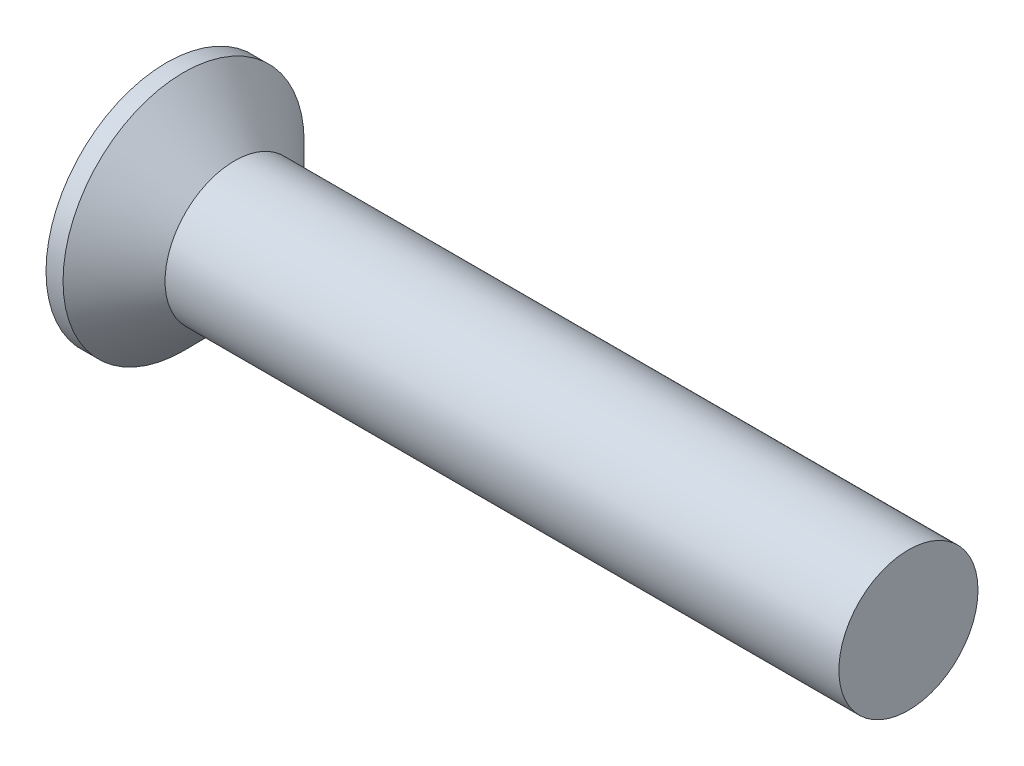
ISO-10303-21;
HEADER;
FILE_DESCRIPTION(('STEP AP214'),'2;1');
FILE_NAME('part.step','',(''),(''),'','','');
FILE_SCHEMA(('AUTOMOTIVE_DESIGN { 1 0 10303 214 1 1 1 1 }'));
ENDSEC;
DATA;
#1=APPLICATION_CONTEXT('core data for automotive mechanical design processes');
#2=APPLICATION_PROTOCOL_DEFINITION('international standard','automotive_design',2000,#1);
#3=PRODUCT_CONTEXT('',#1,'mechanical');
#4=PRODUCT('Part','Part','',(#3));
#5=PRODUCT_RELATED_PRODUCT_CATEGORY('part','',(#4));
#6=PRODUCT_DEFINITION_FORMATION('','',#4);
#7=PRODUCT_DEFINITION_CONTEXT('part definition',#1,'design');
#8=PRODUCT_DEFINITION('design','',#6,#7);
#9=PRODUCT_DEFINITION_SHAPE('','',#8);
#10=(LENGTH_UNIT() NAMED_UNIT(*) SI_UNIT(.MILLI.,.METRE.));
#11=(NAMED_UNIT(*) PLANE_ANGLE_UNIT() SI_UNIT($,.RADIAN.));
#12=(NAMED_UNIT(*) SI_UNIT($,.STERADIAN.) SOLID_ANGLE_UNIT());
#13=UNCERTAINTY_MEASURE_WITH_UNIT(LENGTH_MEASURE(1.E-05),#10,'distance_accuracy_value','');
#14=(GEOMETRIC_REPRESENTATION_CONTEXT(3) GLOBAL_UNCERTAINTY_ASSIGNED_CONTEXT((#13)) GLOBAL_UNIT_ASSIGNED_CONTEXT((#10,
#11,#12)) REPRESENTATION_CONTEXT('',''));
#15=CARTESIAN_POINT('',(0.,0.,0.));
#16=DIRECTION('',(0.,0.,1.));
#17=DIRECTION('',(1.,0.,0.));
#18=AXIS2_PLACEMENT_3D('',#15,#16,#17);
#19=CARTESIAN_POINT('',(16.,1.5,0.));
#20=DIRECTION('',(1.,0.,0.));
#21=DIRECTION('',(0.,0.,-1.));
#22=AXIS2_PLACEMENT_3D('',#19,#20,#21);
#23=PLANE('',#22);
#24=CARTESIAN_POINT('',(16.,0.,0.));
#25=DIRECTION('',(1.,0.,0.));
#26=DIRECTION('',(0.,0.,-1.));
#27=AXIS2_PLACEMENT_3D('',#24,#25,#26);
#28=CIRCLE('',#27,1.5);
#29=CARTESIAN_POINT('',(16.,0.,-1.5));
#30=VERTEX_POINT('',#29);
#31=EDGE_CURVE('E212',#30,#30,#28,.T.);
#32=ORIENTED_EDGE('',*,*,#31,.T.);
#33=EDGE_LOOP('',(#32));
#34=FACE_BOUND('',#33,.T.);
#35=ADVANCED_FACE('F39',(#34),#23,.T.);
#36=CARTESIAN_POINT('',(4.4785714285714,0.,0.));
#37=DIRECTION('',(0.,0.,1.));
#38=DIRECTION('',(1.,0.,0.));
#39=AXIS2_PLACEMENT_3D('',#36,#37,#38);
#40=SPHERICAL_SURFACE('',#39,5.1785714285714);
#41=CARTESIAN_POINT('',(4.4785714285714,-0.34,0.));
#42=DIRECTION('',(0.,-1.,0.));
#43=DIRECTION('',(0.,0.,-1.));
#44=AXIS2_PLACEMENT_3D('',#41,#42,#43);
#45=CIRCLE('',#44,5.16739799520185);
#46=CARTESIAN_POINT('',(-0.649040300178743,-0.34,0.64));
#47=VERTEX_POINT('',#46);
#48=CARTESIAN_POINT('',(-0.449236221463886,-0.34,1.55522146495917));
#49=VERTEX_POINT('',#48);
#50=EDGE_CURVE('E216',#47,#49,#45,.F.);
#51=ORIENTED_EDGE('',*,*,#50,.F.);
#52=CARTESIAN_POINT('',(-0.649040300178743,-0.34,0.64));
#53=CARTESIAN_POINT('',(-0.651125092654162,-0.339985289450023,0.623311452140583));
#54=CARTESIAN_POINT('',(-0.653033929290357,-0.341391829430021,0.606601424650036));
#55=CARTESIAN_POINT('',(-0.656452170050108,-0.346964127621354,0.5736121624894));
#56=CARTESIAN_POINT('',(-0.657961718297668,-0.351128888339867,0.557332774293918));
#57=CARTESIAN_POINT('',(-0.660536487111274,-0.362138947374793,0.525652873141929));
#58=CARTESIAN_POINT('',(-0.661601343834686,-0.368986431829208,0.510253088726624));
#59=CARTESIAN_POINT('',(-0.663252998096254,-0.385171176182099,0.480800931998128));
#60=CARTESIAN_POINT('',(-0.663839957231515,-0.394507593050013,0.466748105641541));
#61=CARTESIAN_POINT('',(-0.664515452071121,-0.415321472159786,0.4405062565739));
#62=CARTESIAN_POINT('',(-0.664608082666446,-0.426780527999705,0.428302737690038));
#63=CARTESIAN_POINT('',(-0.664303114987311,-0.451564797074484,0.405969181412248));
#64=CARTESIAN_POINT('',(-0.663905445161817,-0.464890282431521,0.395839446903564));
#65=CARTESIAN_POINT('',(-0.662634307516274,-0.492968256658572,0.37797394516552));
#66=CARTESIAN_POINT('',(-0.661762583572711,-0.507715353336347,0.370229565624028));
#67=CARTESIAN_POINT('',(-0.659570189800753,-0.538256524979789,0.357293431751204));
#68=CARTESIAN_POINT('',(-0.658249676480977,-0.554050233411553,0.352100789081599));
#69=CARTESIAN_POINT('',(-0.655638949519574,-0.58159529125856,0.345503933478422));
#70=CARTESIAN_POINT('',(-0.654449232328965,-0.593202962798242,0.343439686525628));
#71=CARTESIAN_POINT('',(-0.651881654056928,-0.616542796288321,0.34068755770359));
#72=CARTESIAN_POINT('',(-0.650504065142034,-0.628274755914445,0.339997706931737));
#73=CARTESIAN_POINT('',(-0.649040300178742,-0.64,0.34));
#74=B_SPLINE_CURVE_WITH_KNOTS('',3,(#52,#53,#54,#55,#56,#57,#58,#59,#60,#61,#62,#63,#64,#65,#66,
#67,#68,#69,#70,#71,#72,#73),.UNSPECIFIED.,.F.,.F.,(4,2,2,2,2,2,2,2,2,2,4),(0.,
0.0503945846133996,0.100770954293446,0.151188461094856,0.201588912545959,0.251571204016887,
0.301560790419327,0.351367714764633,0.401157287478689,0.436628333814892,0.472048529167462),.UNSPECIFIED.);
#75=CARTESIAN_POINT('',(-0.649040300178743,-0.64,0.34));
#76=VERTEX_POINT('',#75);
#77=EDGE_CURVE('E271',#47,#76,#74,.T.);
#78=ORIENTED_EDGE('',*,*,#77,.T.);
#79=CARTESIAN_POINT('',(4.4785714285714,0.,0.34));
#80=DIRECTION('',(0.,0.,1.));
#81=DIRECTION('',(1.,0.,0.));
#82=AXIS2_PLACEMENT_3D('',#79,#80,#81);
#83=CIRCLE('',#82,5.16739799520185);
#84=CARTESIAN_POINT('',(-0.449236221463887,-1.55522146495917,0.34));
#85=VERTEX_POINT('',#84);
#86=EDGE_CURVE('E190',#85,#76,#83,.F.);
#87=ORIENTED_EDGE('',*,*,#86,.F.);
#88=CARTESIAN_POINT('',(3.92005016464532,0.967387206227558,0.));
#89=DIRECTION('',(-0.500000000000001,0.866025403784438,0.));
#90=DIRECTION('',(-0.866025403784438,-0.500000000000001,0.));
#91=AXIS2_PLACEMENT_3D('',#88,#89,#90);
#92=CIRCLE('',#91,5.05666075901733);
#93=CARTESIAN_POINT('',(-0.449236221463887,-1.55522146495917,-0.339999999999999));
#94=VERTEX_POINT('',#93);
#95=EDGE_CURVE('E228',#94,#85,#92,.T.);
#96=ORIENTED_EDGE('',*,*,#95,.F.);
#97=CARTESIAN_POINT('',(4.4785714285714,0.,-0.34));
#98=DIRECTION('',(0.,0.,-1.));
#99=DIRECTION('',(0.,1.,0.));
#100=AXIS2_PLACEMENT_3D('',#97,#98,#99);
#101=CIRCLE('',#100,5.16739799520185);
#102=CARTESIAN_POINT('',(-0.649040300178743,-0.64,-0.34));
#103=VERTEX_POINT('',#102);
#104=EDGE_CURVE('E184',#103,#94,#101,.F.);
#105=ORIENTED_EDGE('',*,*,#104,.F.);
#106=CARTESIAN_POINT('',(-0.649040300178743,-0.64,-0.34));
#107=CARTESIAN_POINT('',(-0.651125092654162,-0.623311452140583,-0.339985289450022));
#108=CARTESIAN_POINT('',(-0.653033929290357,-0.606601424650036,-0.34139182943002));
#109=CARTESIAN_POINT('',(-0.656452170050108,-0.5736121624894,-0.346964127621354));
#110=CARTESIAN_POINT('',(-0.657961718297668,-0.557332774293918,-0.351128888339867));
#111=CARTESIAN_POINT('',(-0.660536487111274,-0.525652873141929,-0.362138947374792));
#112=CARTESIAN_POINT('',(-0.661601343834686,-0.510253088726624,-0.368986431829208));
#113=CARTESIAN_POINT('',(-0.663252998096254,-0.480800931998128,-0.385171176182099));
#114=CARTESIAN_POINT('',(-0.663839957231515,-0.466748105641541,-0.394507593050012));
#115=CARTESIAN_POINT('',(-0.664515452071121,-0.4405062565739,-0.415321472159785));
#116=CARTESIAN_POINT('',(-0.664608082666446,-0.428302737690037,-0.426780527999705));
#117=CARTESIAN_POINT('',(-0.664303114987311,-0.405969181412248,-0.451564797074484));
#118=CARTESIAN_POINT('',(-0.663905445161817,-0.395839446903564,-0.464890282431521));
#119=CARTESIAN_POINT('',(-0.662634307516274,-0.37797394516552,-0.492968256658571));
#120=CARTESIAN_POINT('',(-0.661762583572711,-0.370229565624028,-0.507715353336347));
#121=CARTESIAN_POINT('',(-0.659570189800753,-0.357293431751204,-0.538256524979788));
#122=CARTESIAN_POINT('',(-0.658249676480977,-0.352100789081599,-0.554050233411553));
#123=CARTESIAN_POINT('',(-0.655638949519574,-0.345503933478422,-0.581595291258559));
#124=CARTESIAN_POINT('',(-0.654449232328965,-0.343439686525628,-0.593202962798242));
#125=CARTESIAN_POINT('',(-0.651881654056928,-0.34068755770359,-0.61654279628832));
#126=CARTESIAN_POINT('',(-0.650504065142034,-0.339997706931737,-0.628274755914444));
#127=CARTESIAN_POINT('',(-0.649040300178742,-0.34,-0.639999999999999));
#128=B_SPLINE_CURVE_WITH_KNOTS('',3,(#106,#107,#108,#109,#110,#111,#112,#113,#114,#115,#116,
#117,#118,#119,#120,#121,#122,#123,#124,#125,#126,#127),.UNSPECIFIED.,.F.,.F.,(4,2,2,2,2,2,2,2,
2,2,4),(0.,0.0503945846133995,0.100770954293446,0.151188461094855,0.201588912545959,
0.251571204016887,0.301560790419327,0.351367714764633,0.401157287478689,0.436628333814892,
0.472048529167462),.UNSPECIFIED.);
#129=CARTESIAN_POINT('',(-0.649040300178743,-0.34,-0.639999999999999));
#130=VERTEX_POINT('',#129);
#131=EDGE_CURVE('E265',#103,#130,#128,.T.);
#132=ORIENTED_EDGE('',*,*,#131,.T.);
#133=CARTESIAN_POINT('',(4.4785714285714,-0.34,0.));
#134=DIRECTION('',(0.,-1.,0.));
#135=DIRECTION('',(0.,0.,-1.));
#136=AXIS2_PLACEMENT_3D('',#133,#134,#135);
#137=CIRCLE('',#136,5.16739799520185);
#138=CARTESIAN_POINT('',(-0.449236221463887,-0.34,-1.55522146495917));
#139=VERTEX_POINT('',#138);
#140=EDGE_CURVE('E181',#139,#130,#137,.F.);
#141=ORIENTED_EDGE('',*,*,#140,.F.);
#142=CARTESIAN_POINT('',(3.92005016464532,0.,0.967387206227558));
#143=DIRECTION('',(-0.500000000000001,0.,0.866025403784438));
#144=DIRECTION('',(0.866025403784438,0.,0.500000000000001));
#145=AXIS2_PLACEMENT_3D('',#142,#143,#144);
#146=CIRCLE('',#145,5.05666075901733);
#147=CARTESIAN_POINT('',(-0.449236221463887,0.34,-1.55522146495917));
#148=VERTEX_POINT('',#147);
#149=EDGE_CURVE('E169',#148,#139,#146,.T.);
#150=ORIENTED_EDGE('',*,*,#149,.F.);
#151=CARTESIAN_POINT('',(4.4785714285714,0.34,0.));
#152=DIRECTION('',(0.,1.,0.));
#153=DIRECTION('',(0.,0.,1.));
#154=AXIS2_PLACEMENT_3D('',#151,#152,#153);
#155=CIRCLE('',#154,5.16739799520185);
#156=CARTESIAN_POINT('',(-0.649040300178743,0.34,-0.64));
#157=VERTEX_POINT('',#156);
#158=EDGE_CURVE('E154',#157,#148,#155,.F.);
#159=ORIENTED_EDGE('',*,*,#158,.F.);
#160=CARTESIAN_POINT('',(-0.649040300178743,0.34,-0.64));
#161=CARTESIAN_POINT('',(-0.651125092654162,0.339985289450023,-0.623311452140583));
#162=CARTESIAN_POINT('',(-0.653033929290357,0.341391829430021,-0.606601424650036));
#163=CARTESIAN_POINT('',(-0.656452170050108,0.346964127621354,-0.5736121624894));
#164=CARTESIAN_POINT('',(-0.657961718297668,0.351128888339867,-0.557332774293917));
#165=CARTESIAN_POINT('',(-0.660536487111274,0.362138947374793,-0.525652873141928));
#166=CARTESIAN_POINT('',(-0.661601343834686,0.368986431829208,-0.510253088726624));
#167=CARTESIAN_POINT('',(-0.663252998096254,0.385171176182099,-0.480800931998128));
#168=CARTESIAN_POINT('',(-0.663839957231515,0.394507593050013,-0.466748105641541));
#169=CARTESIAN_POINT('',(-0.664515452071121,0.415321472159785,-0.4405062565739));
#170=CARTESIAN_POINT('',(-0.664608082666446,0.426780527999705,-0.428302737690037));
#171=CARTESIAN_POINT('',(-0.664303114987311,0.451564797074484,-0.405969181412247));
#172=CARTESIAN_POINT('',(-0.663905445161817,0.464890282431521,-0.395839446903563));
#173=CARTESIAN_POINT('',(-0.662634307516274,0.492968256658572,-0.37797394516552));
#174=CARTESIAN_POINT('',(-0.661762583572711,0.507715353336347,-0.370229565624028));
#175=CARTESIAN_POINT('',(-0.659570189800753,0.538256524979789,-0.357293431751204));
#176=CARTESIAN_POINT('',(-0.658249676480977,0.554050233411553,-0.352100789081598));
#177=CARTESIAN_POINT('',(-0.655638949519574,0.581595291258559,-0.345503933478421));
#178=CARTESIAN_POINT('',(-0.654449232328965,0.593202962798242,-0.343439686525627));
#179=CARTESIAN_POINT('',(-0.651881654056928,0.616542796288321,-0.34068755770359));
#180=CARTESIAN_POINT('',(-0.650504065142034,0.628274755914444,-0.339997706931736));
#181=CARTESIAN_POINT('',(-0.649040300178742,0.64,-0.34));
#182=B_SPLINE_CURVE_WITH_KNOTS('',3,(#160,#161,#162,#163,#164,#165,#166,#167,#168,#169,#170,
#171,#172,#173,#174,#175,#176,#177,#178,#179,#180,#181),.UNSPECIFIED.,.F.,.F.,(4,2,2,2,2,2,2,2,
2,2,4),(0.,0.0503945846133995,0.100770954293446,0.151188461094855,0.201588912545959,
0.251571204016887,0.301560790419327,0.351367714764633,0.401157287478689,0.436628333814891,
0.472048529167462),.UNSPECIFIED.);
#183=CARTESIAN_POINT('',(-0.649040300178743,0.64,-0.34));
#184=VERTEX_POINT('',#183);
#185=EDGE_CURVE('E248',#157,#184,#182,.T.);
#186=ORIENTED_EDGE('',*,*,#185,.T.);
#187=CARTESIAN_POINT('',(4.4785714285714,0.,-0.34));
#188=DIRECTION('',(0.,0.,-1.));
#189=DIRECTION('',(0.,1.,0.));
#190=AXIS2_PLACEMENT_3D('',#187,#188,#189);
#191=CIRCLE('',#190,5.16739799520185);
#192=CARTESIAN_POINT('',(-0.449236221463887,1.55522146495917,-0.34));
#193=VERTEX_POINT('',#192);
#194=EDGE_CURVE('E165',#193,#184,#191,.F.);
#195=ORIENTED_EDGE('',*,*,#194,.F.);
#196=CARTESIAN_POINT('',(3.92005016464532,-0.967387206227558,0.));
#197=DIRECTION('',(-0.500000000000001,-0.866025403784438,0.));
#198=DIRECTION('',(0.866025403784438,-0.500000000000001,0.));
#199=AXIS2_PLACEMENT_3D('',#196,#197,#198);
#200=CIRCLE('',#199,5.05666075901733);
#201=CARTESIAN_POINT('',(-0.449236221463887,1.55522146495917,0.34));
#202=VERTEX_POINT('',#201);
#203=EDGE_CURVE('E198',#202,#193,#200,.T.);
#204=ORIENTED_EDGE('',*,*,#203,.F.);
#205=CARTESIAN_POINT('',(4.4785714285714,0.,0.34));
#206=DIRECTION('',(0.,0.,1.));
#207=DIRECTION('',(1.,0.,0.));
#208=AXIS2_PLACEMENT_3D('',#205,#206,#207);
#209=CIRCLE('',#208,5.16739799520185);
#210=CARTESIAN_POINT('',(-0.649040300178743,0.64,0.34));
#211=VERTEX_POINT('',#210);
#212=EDGE_CURVE('E200',#211,#202,#209,.F.);
#213=ORIENTED_EDGE('',*,*,#212,.F.);
#214=CARTESIAN_POINT('',(-0.649040300178743,0.64,0.34));
#215=CARTESIAN_POINT('',(-0.651125092654162,0.623311452140583,0.339985289450023));
#216=CARTESIAN_POINT('',(-0.653033929290357,0.606601424650036,0.341391829430021));
#217=CARTESIAN_POINT('',(-0.656452170050108,0.5736121624894,0.346964127621354));
#218=CARTESIAN_POINT('',(-0.657961718297668,0.557332774293918,0.351128888339867));
#219=CARTESIAN_POINT('',(-0.660536487111274,0.525652873141928,0.362138947374793));
#220=CARTESIAN_POINT('',(-0.661601343834686,0.510253088726624,0.368986431829208));
#221=CARTESIAN_POINT('',(-0.663252998096254,0.480800931998128,0.3851711761821));
#222=CARTESIAN_POINT('',(-0.663839957231515,0.466748105641541,0.394507593050013));
#223=CARTESIAN_POINT('',(-0.664515452071121,0.4405062565739,0.415321472159786));
#224=CARTESIAN_POINT('',(-0.664608082666446,0.428302737690037,0.426780527999705));
#225=CARTESIAN_POINT('',(-0.664303114987311,0.405969181412247,0.451564797074485));
#226=CARTESIAN_POINT('',(-0.663905445161817,0.395839446903564,0.464890282431521));
#227=CARTESIAN_POINT('',(-0.662634307516274,0.37797394516552,0.492968256658572));
#228=CARTESIAN_POINT('',(-0.661762583572711,0.370229565624028,0.507715353336348));
#229=CARTESIAN_POINT('',(-0.659570189800753,0.357293431751204,0.538256524979789));
#230=CARTESIAN_POINT('',(-0.658249676480977,0.352100789081598,0.554050233411554));
#231=CARTESIAN_POINT('',(-0.655638949519574,0.345503933478422,0.58159529125856));
#232=CARTESIAN_POINT('',(-0.654449232328965,0.343439686525628,0.593202962798242));
#233=CARTESIAN_POINT('',(-0.651881654056928,0.34068755770359,0.616542796288321));
#234=CARTESIAN_POINT('',(-0.650504065142034,0.339997706931736,0.628274755914445));
#235=CARTESIAN_POINT('',(-0.649040300178742,0.34,0.64));
#236=B_SPLINE_CURVE_WITH_KNOTS('',3,(#214,#215,#216,#217,#218,#219,#220,#221,#222,#223,#224,
#225,#226,#227,#228,#229,#230,#231,#232,#233,#234,#235),.UNSPECIFIED.,.F.,.F.,(4,2,2,2,2,2,2,2,
2,2,4),(0.,0.0503945846133995,0.100770954293446,0.151188461094856,0.201588912545959,
0.251571204016887,0.301560790419327,0.351367714764633,0.401157287478689,0.436628333814891,
0.472048529167462),.UNSPECIFIED.);
#237=CARTESIAN_POINT('',(-0.649040300178743,0.34,0.64));
#238=VERTEX_POINT('',#237);
#239=EDGE_CURVE('E241',#211,#238,#236,.T.);
#240=ORIENTED_EDGE('',*,*,#239,.T.);
#241=CARTESIAN_POINT('',(4.4785714285714,0.34,0.));
#242=DIRECTION('',(0.,1.,0.));
#243=DIRECTION('',(0.,0.,1.));
#244=AXIS2_PLACEMENT_3D('',#241,#242,#243);
#245=CIRCLE('',#244,5.16739799520185);
#246=CARTESIAN_POINT('',(-0.449236221463886,0.34,1.55522146495917));
#247=VERTEX_POINT('',#246);
#248=EDGE_CURVE('E215',#247,#238,#245,.F.);
#249=ORIENTED_EDGE('',*,*,#248,.F.);
#250=CARTESIAN_POINT('',(3.92005016464532,0.,-0.967387206227558));
#251=DIRECTION('',(-0.500000000000001,0.,-0.866025403784438));
#252=DIRECTION('',(-0.866025403784438,0.,0.500000000000001));
#253=AXIS2_PLACEMENT_3D('',#250,#251,#252);
#254=CIRCLE('',#253,5.05666075901733);
#255=EDGE_CURVE('E213',#49,#247,#254,.T.);
#256=ORIENTED_EDGE('',*,*,#255,.F.);
#257=EDGE_LOOP('',(#51,#78,#87,#96,#105,#132,#141,#150,#159,#186,#195,#204,#213,#240,#249,#256));
#258=FACE_BOUND('',#257,.T.);
#259=CARTESIAN_POINT('',(0.,0.,0.));
#260=DIRECTION('',(1.,0.,0.));
#261=DIRECTION('',(0.,0.,-1.));
#262=AXIS2_PLACEMENT_3D('',#259,#260,#261);
#263=CIRCLE('',#262,2.59999999999999);
#264=CARTESIAN_POINT('',(0.,0.,-2.59999999999999));
#265=VERTEX_POINT('',#264);
#266=EDGE_CURVE('E182',#265,#265,#263,.T.);
#267=ORIENTED_EDGE('',*,*,#266,.F.);
#268=EDGE_LOOP('',(#267));
#269=FACE_BOUND('',#268,.T.);
#270=ADVANCED_FACE('F178',(#258,#269),#40,.T.);
#271=CARTESIAN_POINT('',(4.51581291088132,0.,0.));
#272=DIRECTION('',(1.,0.,0.));
#273=DIRECTION('',(0.,0.,-1.));
#274=AXIS2_PLACEMENT_3D('',#271,#272,#273);
#275=CYLINDRICAL_SURFACE('',#274,2.59999999999999);
#276=ORIENTED_EDGE('',*,*,#266,.T.);
#277=EDGE_LOOP('',(#276));
#278=FACE_BOUND('',#277,.T.);
#279=CARTESIAN_POINT('',(0.367367965644047,0.,0.));
#280=DIRECTION('',(1.,0.,0.));
#281=DIRECTION('',(0.,0.,-1.));
#282=AXIS2_PLACEMENT_3D('',#279,#280,#281);
#283=CIRCLE('',#282,2.59999999999999);
#284=CARTESIAN_POINT('',(0.367367965644047,0.,-2.59999999999999));
#285=VERTEX_POINT('',#284);
#286=EDGE_CURVE('E187',#285,#285,#283,.T.);
#287=ORIENTED_EDGE('',*,*,#286,.F.);
#288=EDGE_LOOP('',(#287));
#289=FACE_BOUND('',#288,.T.);
#290=ADVANCED_FACE('F258',(#278,#289),#275,.T.);
#291=CARTESIAN_POINT('',(1.46736796564404,0.,0.));
#292=DIRECTION('',(-1.,0.,0.));
#293=DIRECTION('',(0.,0.,1.));
#294=AXIS2_PLACEMENT_3D('',#291,#292,#293);
#295=CONICAL_SURFACE('',#294,1.49999999999999,0.78539816339745);
#296=ORIENTED_EDGE('',*,*,#286,.T.);
#297=EDGE_LOOP('',(#296));
#298=FACE_BOUND('',#297,.T.);
#299=CARTESIAN_POINT('',(1.46736796564404,0.,0.));
#300=DIRECTION('',(1.,0.,0.));
#301=DIRECTION('',(0.,0.,-1.));
#302=AXIS2_PLACEMENT_3D('',#299,#300,#301);
#303=CIRCLE('',#302,1.49999999999999);
#304=CARTESIAN_POINT('',(1.46736796564404,0.,-1.49999999999999));
#305=VERTEX_POINT('',#304);
#306=EDGE_CURVE('E301',#305,#305,#303,.T.);
#307=ORIENTED_EDGE('',*,*,#306,.F.);
#308=EDGE_LOOP('',(#307));
#309=FACE_BOUND('',#308,.T.);
#310=ADVANCED_FACE('F403',(#298,#309),#295,.T.);
#311=CARTESIAN_POINT('',(4.51581291088132,0.,0.));
#312=DIRECTION('',(1.,0.,0.));
#313=DIRECTION('',(0.,0.,-1.));
#314=AXIS2_PLACEMENT_3D('',#311,#312,#313);
#315=CYLINDRICAL_SURFACE('',#314,1.5);
#316=ORIENTED_EDGE('',*,*,#306,.T.);
#317=EDGE_LOOP('',(#316));
#318=FACE_BOUND('',#317,.T.);
#319=ORIENTED_EDGE('',*,*,#31,.F.);
#320=EDGE_LOOP('',(#319));
#321=FACE_BOUND('',#320,.T.);
#322=ADVANCED_FACE('F400',(#318,#321),#315,.T.);
#323=CARTESIAN_POINT('',(0.125,0.34,-0.34));
#324=DIRECTION('',(0.,1.,0.));
#325=DIRECTION('',(0.,0.,1.));
#326=AXIS2_PLACEMENT_3D('',#323,#324,#325);
#327=PLANE('',#326);
#328=DIRECTION('',(0.,0.,-1.));
#329=VECTOR('',#328,1.);
#330=CARTESIAN_POINT('',(0.125,0.34,-0.34));
#331=LINE('',#330,#329);
#332=CARTESIAN_POINT('',(0.125,0.34,-0.64));
#333=VERTEX_POINT('',#332);
#334=CARTESIAN_POINT('',(0.125,0.34,-1.22368602791856));
#335=VERTEX_POINT('',#334);
#336=EDGE_CURVE('E195',#333,#335,#331,.T.);
#337=ORIENTED_EDGE('',*,*,#336,.F.);
#338=DIRECTION('',(-1.,0.,0.));
#339=VECTOR('',#338,1.);
#340=CARTESIAN_POINT('',(0.125,0.34,-0.64));
#341=LINE('',#340,#339);
#342=EDGE_CURVE('E161',#333,#157,#341,.T.);
#343=ORIENTED_EDGE('',*,*,#342,.T.);
#344=ORIENTED_EDGE('',*,*,#158,.T.);
#345=DIRECTION('',(0.866025403784438,0.,0.500000000000001));
#346=VECTOR('',#345,1.);
#347=CARTESIAN_POINT('',(0.507647274573419,0.34,-1.00276452093892));
#348=LINE('',#347,#346);
#349=EDGE_CURVE('E158',#335,#148,#348,.F.);
#350=ORIENTED_EDGE('',*,*,#349,.F.);
#351=EDGE_LOOP('',(#337,#343,#344,#350));
#352=FACE_BOUND('',#351,.T.);
#353=ADVANCED_FACE('F157',(#352),#327,.F.);
#354=CARTESIAN_POINT('',(0.125,0.34,-0.34));
#355=DIRECTION('',(0.,0.,-1.));
#356=DIRECTION('',(0.,1.,0.));
#357=AXIS2_PLACEMENT_3D('',#354,#355,#356);
#358=PLANE('',#357);
#359=ORIENTED_EDGE('',*,*,#194,.T.);
#360=DIRECTION('',(-1.,0.,0.));
#361=VECTOR('',#360,1.);
#362=CARTESIAN_POINT('',(0.125,0.64,-0.34));
#363=LINE('',#362,#361);
#364=CARTESIAN_POINT('',(0.125,0.64,-0.34));
#365=VERTEX_POINT('',#364);
#366=EDGE_CURVE('E343',#184,#365,#363,.F.);
#367=ORIENTED_EDGE('',*,*,#366,.T.);
#368=DIRECTION('',(0.,-1.,0.));
#369=VECTOR('',#368,1.);
#370=CARTESIAN_POINT('',(0.125,0.34,-0.34));
#371=LINE('',#370,#369);
#372=CARTESIAN_POINT('',(0.125,1.22368602791856,-0.34));
#373=VERTEX_POINT('',#372);
#374=EDGE_CURVE('E174',#373,#365,#371,.T.);
#375=ORIENTED_EDGE('',*,*,#374,.F.);
#376=DIRECTION('',(0.866025403784438,-0.500000000000001,0.));
#377=VECTOR('',#376,1.);
#378=CARTESIAN_POINT('',(-0.7,1.7,-0.34));
#379=LINE('',#378,#377);
#380=EDGE_CURVE('E204',#373,#193,#379,.F.);
#381=ORIENTED_EDGE('',*,*,#380,.T.);
#382=EDGE_LOOP('',(#359,#367,#375,#381));
#383=FACE_BOUND('',#382,.T.);
#384=ADVANCED_FACE('F359',(#383),#358,.F.);
#385=CARTESIAN_POINT('',(-0.7,1.7,0.));
#386=DIRECTION('',(-0.500000000000001,-0.866025403784438,0.));
#387=DIRECTION('',(0.866025403784438,-0.500000000000001,0.));
#388=AXIS2_PLACEMENT_3D('',#385,#386,#387);
#389=PLANE('',#388);
#390=ORIENTED_EDGE('',*,*,#203,.T.);
#391=ORIENTED_EDGE('',*,*,#380,.F.);
#392=DIRECTION('',(0.,0.,1.));
#393=VECTOR('',#392,1.);
#394=CARTESIAN_POINT('',(0.125,1.22368602791856,-0.34));
#395=LINE('',#394,#393);
#396=CARTESIAN_POINT('',(0.125,1.22368602791856,0.34));
#397=VERTEX_POINT('',#396);
#398=EDGE_CURVE('E206',#397,#373,#395,.F.);
#399=ORIENTED_EDGE('',*,*,#398,.F.);
#400=DIRECTION('',(0.866025403784438,-0.500000000000001,0.));
#401=VECTOR('',#400,1.);
#402=CARTESIAN_POINT('',(0.507647274573418,1.00276452093892,0.34));
#403=LINE('',#402,#401);
#404=EDGE_CURVE('E201',#397,#202,#403,.F.);
#405=ORIENTED_EDGE('',*,*,#404,.T.);
#406=EDGE_LOOP('',(#390,#391,#399,#405));
#407=FACE_BOUND('',#406,.T.);
#408=ADVANCED_FACE('F362',(#407),#389,.T.);
#409=CARTESIAN_POINT('',(0.125,0.34,0.34));
#410=DIRECTION('',(0.,0.,1.));
#411=DIRECTION('',(1.,0.,0.));
#412=AXIS2_PLACEMENT_3D('',#409,#410,#411);
#413=PLANE('',#412);
#414=DIRECTION('',(0.,1.,0.));
#415=VECTOR('',#414,1.);
#416=CARTESIAN_POINT('',(0.125,0.34,0.34));
#417=LINE('',#416,#415);
#418=CARTESIAN_POINT('',(0.125,0.64,0.34));
#419=VERTEX_POINT('',#418);
#420=EDGE_CURVE('E209',#419,#397,#417,.T.);
#421=ORIENTED_EDGE('',*,*,#420,.F.);
#422=DIRECTION('',(-1.,0.,0.));
#423=VECTOR('',#422,1.);
#424=CARTESIAN_POINT('',(0.125,0.64,0.34));
#425=LINE('',#424,#423);
#426=EDGE_CURVE('E345',#419,#211,#425,.T.);
#427=ORIENTED_EDGE('',*,*,#426,.T.);
#428=ORIENTED_EDGE('',*,*,#212,.T.);
#429=ORIENTED_EDGE('',*,*,#404,.F.);
#430=EDGE_LOOP('',(#421,#427,#428,#429));
#431=FACE_BOUND('',#430,.T.);
#432=ADVANCED_FACE('F366',(#431),#413,.F.);
#433=CARTESIAN_POINT('',(0.125,0.34,0.34));
#434=DIRECTION('',(0.,1.,0.));
#435=DIRECTION('',(0.,0.,1.));
#436=AXIS2_PLACEMENT_3D('',#433,#434,#435);
#437=PLANE('',#436);
#438=ORIENTED_EDGE('',*,*,#248,.T.);
#439=DIRECTION('',(-1.,0.,0.));
#440=VECTOR('',#439,1.);
#441=CARTESIAN_POINT('',(0.125,0.34,0.64));
#442=LINE('',#441,#440);
#443=CARTESIAN_POINT('',(0.125,0.34,0.64));
#444=VERTEX_POINT('',#443);
#445=EDGE_CURVE('E55',#238,#444,#442,.F.);
#446=ORIENTED_EDGE('',*,*,#445,.T.);
#447=DIRECTION('',(0.,0.,-1.));
#448=VECTOR('',#447,1.);
#449=CARTESIAN_POINT('',(0.125,0.34,0.34));
#450=LINE('',#449,#448);
#451=CARTESIAN_POINT('',(0.125,0.34,1.22368602791856));
#452=VERTEX_POINT('',#451);
#453=EDGE_CURVE('E224',#452,#444,#450,.T.);
#454=ORIENTED_EDGE('',*,*,#453,.F.);
#455=DIRECTION('',(0.866025403784438,0.,-0.500000000000001));
#456=VECTOR('',#455,1.);
#457=CARTESIAN_POINT('',(-0.7,0.34,1.7));
#458=LINE('',#457,#456);
#459=EDGE_CURVE('E205',#452,#247,#458,.F.);
#460=ORIENTED_EDGE('',*,*,#459,.T.);
#461=EDGE_LOOP('',(#438,#446,#454,#460));
#462=FACE_BOUND('',#461,.T.);
#463=ADVANCED_FACE('F370',(#462),#437,.F.);
#464=CARTESIAN_POINT('',(-0.7,0.,1.7));
#465=DIRECTION('',(-0.500000000000001,0.,-0.866025403784438));
#466=DIRECTION('',(-0.866025403784438,0.,0.500000000000001));
#467=AXIS2_PLACEMENT_3D('',#464,#465,#466);
#468=PLANE('',#467);
#469=ORIENTED_EDGE('',*,*,#255,.T.);
#470=ORIENTED_EDGE('',*,*,#459,.F.);
#471=DIRECTION('',(0.,-1.,0.));
#472=VECTOR('',#471,1.);
#473=CARTESIAN_POINT('',(0.125,0.34,1.22368602791856));
#474=LINE('',#473,#472);
#475=CARTESIAN_POINT('',(0.125,-0.34,1.22368602791856));
#476=VERTEX_POINT('',#475);
#477=EDGE_CURVE('E221',#476,#452,#474,.F.);
#478=ORIENTED_EDGE('',*,*,#477,.F.);
#479=DIRECTION('',(0.866025403784438,0.,-0.500000000000001));
#480=VECTOR('',#479,1.);
#481=CARTESIAN_POINT('',(0.507647274573419,-0.34,1.00276452093892));
#482=LINE('',#481,#480);
#483=EDGE_CURVE('E217',#476,#49,#482,.F.);
#484=ORIENTED_EDGE('',*,*,#483,.T.);
#485=EDGE_LOOP('',(#469,#470,#478,#484));
#486=FACE_BOUND('',#485,.T.);
#487=ADVANCED_FACE('F373',(#486),#468,.T.);
#488=CARTESIAN_POINT('',(0.125,-0.34,0.34));
#489=DIRECTION('',(0.,-1.,0.));
#490=DIRECTION('',(0.,0.,-1.));
#491=AXIS2_PLACEMENT_3D('',#488,#489,#490);
#492=PLANE('',#491);
#493=DIRECTION('',(0.,0.,1.));
#494=VECTOR('',#493,1.);
#495=CARTESIAN_POINT('',(0.125,-0.34,0.34));
#496=LINE('',#495,#494);
#497=CARTESIAN_POINT('',(0.125,-0.34,0.64));
#498=VERTEX_POINT('',#497);
#499=EDGE_CURVE('E225',#498,#476,#496,.T.);
#500=ORIENTED_EDGE('',*,*,#499,.F.);
#501=DIRECTION('',(-1.,0.,0.));
#502=VECTOR('',#501,1.);
#503=CARTESIAN_POINT('',(0.125,-0.34,0.64));
#504=LINE('',#503,#502);
#505=EDGE_CURVE('E164',#498,#47,#504,.T.);
#506=ORIENTED_EDGE('',*,*,#505,.T.);
#507=ORIENTED_EDGE('',*,*,#50,.T.);
#508=ORIENTED_EDGE('',*,*,#483,.F.);
#509=EDGE_LOOP('',(#500,#506,#507,#508));
#510=FACE_BOUND('',#509,.T.);
#511=ADVANCED_FACE('F377',(#510),#492,.F.);
#512=CARTESIAN_POINT('',(0.125,-0.34,0.34));
#513=DIRECTION('',(0.,0.,1.));
#514=DIRECTION('',(1.,0.,0.));
#515=AXIS2_PLACEMENT_3D('',#512,#513,#514);
#516=PLANE('',#515);
#517=ORIENTED_EDGE('',*,*,#86,.T.);
#518=DIRECTION('',(-1.,0.,0.));
#519=VECTOR('',#518,1.);
#520=CARTESIAN_POINT('',(0.125,-0.64,0.34));
#521=LINE('',#520,#519);
#522=CARTESIAN_POINT('',(0.125,-0.64,0.34));
#523=VERTEX_POINT('',#522);
#524=EDGE_CURVE('E332',#76,#523,#521,.F.);
#525=ORIENTED_EDGE('',*,*,#524,.T.);
#526=DIRECTION('',(0.,1.,0.));
#527=VECTOR('',#526,1.);
#528=CARTESIAN_POINT('',(0.125,-0.34,0.34));
#529=LINE('',#528,#527);
#530=CARTESIAN_POINT('',(0.125,-1.22368602791856,0.34));
#531=VERTEX_POINT('',#530);
#532=EDGE_CURVE('E235',#531,#523,#529,.T.);
#533=ORIENTED_EDGE('',*,*,#532,.F.);
#534=DIRECTION('',(0.866025403784438,0.500000000000001,0.));
#535=VECTOR('',#534,1.);
#536=CARTESIAN_POINT('',(-0.7,-1.7,0.34));
#537=LINE('',#536,#535);
#538=EDGE_CURVE('E220',#531,#85,#537,.F.);
#539=ORIENTED_EDGE('',*,*,#538,.T.);
#540=EDGE_LOOP('',(#517,#525,#533,#539));
#541=FACE_BOUND('',#540,.T.);
#542=ADVANCED_FACE('F330',(#541),#516,.F.);
#543=CARTESIAN_POINT('',(-0.7,-1.7,0.));
#544=DIRECTION('',(-0.500000000000001,0.866025403784438,0.));
#545=DIRECTION('',(-0.866025403784438,-0.500000000000001,0.));
#546=AXIS2_PLACEMENT_3D('',#543,#544,#545);
#547=PLANE('',#546);
#548=ORIENTED_EDGE('',*,*,#95,.T.);
#549=ORIENTED_EDGE('',*,*,#538,.F.);
#550=DIRECTION('',(0.,0.,-1.));
#551=VECTOR('',#550,1.);
#552=CARTESIAN_POINT('',(0.125,-1.22368602791856,-0.34));
#553=LINE('',#552,#551);
#554=CARTESIAN_POINT('',(0.125,-1.22368602791856,-0.339999999999999));
#555=VERTEX_POINT('',#554);
#556=EDGE_CURVE('E232',#555,#531,#553,.F.);
#557=ORIENTED_EDGE('',*,*,#556,.F.);
#558=DIRECTION('',(0.866025403784438,0.500000000000001,0.));
#559=VECTOR('',#558,1.);
#560=CARTESIAN_POINT('',(0.507647274573418,-1.00276452093892,-0.339999999999999));
#561=LINE('',#560,#559);
#562=EDGE_CURVE('E197',#555,#94,#561,.F.);
#563=ORIENTED_EDGE('',*,*,#562,.T.);
#564=EDGE_LOOP('',(#548,#549,#557,#563));
#565=FACE_BOUND('',#564,.T.);
#566=ADVANCED_FACE('F325',(#565),#547,.T.);
#567=CARTESIAN_POINT('',(0.125,-0.34,-0.34));
#568=DIRECTION('',(0.,0.,-1.));
#569=DIRECTION('',(0.,1.,0.));
#570=AXIS2_PLACEMENT_3D('',#567,#568,#569);
#571=PLANE('',#570);
#572=DIRECTION('',(0.,-1.,0.));
#573=VECTOR('',#572,1.);
#574=CARTESIAN_POINT('',(0.125,-0.34,-0.34));
#575=LINE('',#574,#573);
#576=CARTESIAN_POINT('',(0.125,-0.64,-0.34));
#577=VERTEX_POINT('',#576);
#578=EDGE_CURVE('E236',#577,#555,#575,.T.);
#579=ORIENTED_EDGE('',*,*,#578,.F.);
#580=DIRECTION('',(-1.,0.,0.));
#581=VECTOR('',#580,1.);
#582=CARTESIAN_POINT('',(0.125,-0.64,-0.34));
#583=LINE('',#582,#581);
#584=EDGE_CURVE('E322',#577,#103,#583,.T.);
#585=ORIENTED_EDGE('',*,*,#584,.T.);
#586=ORIENTED_EDGE('',*,*,#104,.T.);
#587=ORIENTED_EDGE('',*,*,#562,.F.);
#588=EDGE_LOOP('',(#579,#585,#586,#587));
#589=FACE_BOUND('',#588,.T.);
#590=ADVANCED_FACE('F319',(#589),#571,.F.);
#591=CARTESIAN_POINT('',(0.125,-0.34,-0.34));
#592=DIRECTION('',(0.,-1.,0.));
#593=DIRECTION('',(0.,0.,-1.));
#594=AXIS2_PLACEMENT_3D('',#591,#592,#593);
#595=PLANE('',#594);
#596=ORIENTED_EDGE('',*,*,#140,.T.);
#597=DIRECTION('',(-1.,0.,0.));
#598=VECTOR('',#597,1.);
#599=CARTESIAN_POINT('',(0.125,-0.34,-0.639999999999999));
#600=LINE('',#599,#598);
#601=CARTESIAN_POINT('',(0.125,-0.34,-0.639999999999999));
#602=VERTEX_POINT('',#601);
#603=EDGE_CURVE('E338',#130,#602,#600,.F.);
#604=ORIENTED_EDGE('',*,*,#603,.T.);
#605=DIRECTION('',(0.,0.,1.));
#606=VECTOR('',#605,1.);
#607=CARTESIAN_POINT('',(0.125,-0.34,-0.34));
#608=LINE('',#607,#606);
#609=CARTESIAN_POINT('',(0.125,-0.34,-1.22368602791856));
#610=VERTEX_POINT('',#609);
#611=EDGE_CURVE('E194',#610,#602,#608,.T.);
#612=ORIENTED_EDGE('',*,*,#611,.F.);
#613=DIRECTION('',(0.866025403784438,0.,0.500000000000001));
#614=VECTOR('',#613,1.);
#615=CARTESIAN_POINT('',(-0.7,-0.34,-1.7));
#616=LINE('',#615,#614);
#617=EDGE_CURVE('E173',#610,#139,#616,.F.);
#618=ORIENTED_EDGE('',*,*,#617,.T.);
#619=EDGE_LOOP('',(#596,#604,#612,#618));
#620=FACE_BOUND('',#619,.T.);
#621=ADVANCED_FACE('F388',(#620),#595,.F.);
#622=CARTESIAN_POINT('',(-0.7,0.,-1.7));
#623=DIRECTION('',(-0.500000000000001,0.,0.866025403784438));
#624=DIRECTION('',(0.866025403784438,0.,0.500000000000001));
#625=AXIS2_PLACEMENT_3D('',#622,#623,#624);
#626=PLANE('',#625);
#627=ORIENTED_EDGE('',*,*,#149,.T.);
#628=ORIENTED_EDGE('',*,*,#617,.F.);
#629=DIRECTION('',(0.,1.,0.));
#630=VECTOR('',#629,1.);
#631=CARTESIAN_POINT('',(0.125,0.34,-1.22368602791856));
#632=LINE('',#631,#630);
#633=EDGE_CURVE('E172',#335,#610,#632,.F.);
#634=ORIENTED_EDGE('',*,*,#633,.F.);
#635=ORIENTED_EDGE('',*,*,#349,.T.);
#636=EDGE_LOOP('',(#627,#628,#634,#635));
#637=FACE_BOUND('',#636,.T.);
#638=ADVANCED_FACE('F168',(#637),#626,.T.);
#639=CARTESIAN_POINT('',(0.125,0.34,-0.34));
#640=DIRECTION('',(-1.,0.,0.));
#641=DIRECTION('',(0.,0.,1.));
#642=AXIS2_PLACEMENT_3D('',#639,#640,#641);
#643=PLANE('',#642);
#644=ORIENTED_EDGE('',*,*,#374,.T.);
#645=CARTESIAN_POINT('',(0.125,0.64,-0.64));
#646=DIRECTION('',(-1.,0.,0.));
#647=DIRECTION('',(0.,0.,1.));
#648=AXIS2_PLACEMENT_3D('',#645,#646,#647);
#649=CIRCLE('',#648,0.3);
#650=EDGE_CURVE('E48',#365,#333,#649,.F.);
#651=ORIENTED_EDGE('',*,*,#650,.T.);
#652=ORIENTED_EDGE('',*,*,#336,.T.);
#653=ORIENTED_EDGE('',*,*,#633,.T.);
#654=ORIENTED_EDGE('',*,*,#611,.T.);
#655=CARTESIAN_POINT('',(0.125,-0.64,-0.639999999999999));
#656=DIRECTION('',(-1.,0.,0.));
#657=DIRECTION('',(0.,0.,1.));
#658=AXIS2_PLACEMENT_3D('',#655,#656,#657);
#659=CIRCLE('',#658,0.3);
#660=EDGE_CURVE('E350',#602,#577,#659,.F.);
#661=ORIENTED_EDGE('',*,*,#660,.T.);
#662=ORIENTED_EDGE('',*,*,#578,.T.);
#663=ORIENTED_EDGE('',*,*,#556,.T.);
#664=ORIENTED_EDGE('',*,*,#532,.T.);
#665=CARTESIAN_POINT('',(0.125,-0.64,0.64));
#666=DIRECTION('',(-1.,0.,0.));
#667=DIRECTION('',(0.,0.,1.));
#668=AXIS2_PLACEMENT_3D('',#665,#666,#667);
#669=CIRCLE('',#668,0.3);
#670=EDGE_CURVE('E337',#523,#498,#669,.F.);
#671=ORIENTED_EDGE('',*,*,#670,.T.);
#672=ORIENTED_EDGE('',*,*,#499,.T.);
#673=ORIENTED_EDGE('',*,*,#477,.T.);
#674=ORIENTED_EDGE('',*,*,#453,.T.);
#675=CARTESIAN_POINT('',(0.125,0.64,0.64));
#676=DIRECTION('',(-1.,0.,0.));
#677=DIRECTION('',(0.,0.,1.));
#678=AXIS2_PLACEMENT_3D('',#675,#676,#677);
#679=CIRCLE('',#678,0.3);
#680=EDGE_CURVE('E11',#444,#419,#679,.F.);
#681=ORIENTED_EDGE('',*,*,#680,.T.);
#682=ORIENTED_EDGE('',*,*,#420,.T.);
#683=ORIENTED_EDGE('',*,*,#398,.T.);
#684=EDGE_LOOP('',(#644,#651,#652,#653,#654,#661,#662,#663,#664,#671,#672,#673,#674,#681,#682,#683));
#685=FACE_BOUND('',#684,.T.);
#686=ADVANCED_FACE('F352',(#685),#643,.T.);
#687=CARTESIAN_POINT('',(0.125,-0.64,0.64));
#688=DIRECTION('',(-1.,0.,0.));
#689=DIRECTION('',(0.,0.,1.));
#690=AXIS2_PLACEMENT_3D('',#687,#688,#689);
#691=CYLINDRICAL_SURFACE('',#690,0.3);
#692=ORIENTED_EDGE('',*,*,#670,.F.);
#693=ORIENTED_EDGE('',*,*,#524,.F.);
#694=ORIENTED_EDGE('',*,*,#77,.F.);
#695=ORIENTED_EDGE('',*,*,#505,.F.);
#696=EDGE_LOOP('',(#692,#693,#694,#695));
#697=FACE_BOUND('',#696,.T.);
#698=ADVANCED_FACE('F282',(#697),#691,.T.);
#699=CARTESIAN_POINT('',(0.125,-0.64,-0.639999999999999));
#700=DIRECTION('',(-1.,0.,0.));
#701=DIRECTION('',(0.,0.,1.));
#702=AXIS2_PLACEMENT_3D('',#699,#700,#701);
#703=CYLINDRICAL_SURFACE('',#702,0.3);
#704=ORIENTED_EDGE('',*,*,#660,.F.);
#705=ORIENTED_EDGE('',*,*,#603,.F.);
#706=ORIENTED_EDGE('',*,*,#131,.F.);
#707=ORIENTED_EDGE('',*,*,#584,.F.);
#708=EDGE_LOOP('',(#704,#705,#706,#707));
#709=FACE_BOUND('',#708,.T.);
#710=ADVANCED_FACE('F278',(#709),#703,.T.);
#711=CARTESIAN_POINT('',(0.125,0.64,-0.64));
#712=DIRECTION('',(-1.,0.,0.));
#713=DIRECTION('',(0.,0.,1.));
#714=AXIS2_PLACEMENT_3D('',#711,#712,#713);
#715=CYLINDRICAL_SURFACE('',#714,0.3);
#716=ORIENTED_EDGE('',*,*,#650,.F.);
#717=ORIENTED_EDGE('',*,*,#366,.F.);
#718=ORIENTED_EDGE('',*,*,#185,.F.);
#719=ORIENTED_EDGE('',*,*,#342,.F.);
#720=EDGE_LOOP('',(#716,#717,#718,#719));
#721=FACE_BOUND('',#720,.T.);
#722=ADVANCED_FACE('F281',(#721),#715,.T.);
#723=CARTESIAN_POINT('',(0.125,0.64,0.64));
#724=DIRECTION('',(-1.,0.,0.));
#725=DIRECTION('',(0.,0.,1.));
#726=AXIS2_PLACEMENT_3D('',#723,#724,#725);
#727=CYLINDRICAL_SURFACE('',#726,0.3);
#728=ORIENTED_EDGE('',*,*,#680,.F.);
#729=ORIENTED_EDGE('',*,*,#445,.F.);
#730=ORIENTED_EDGE('',*,*,#239,.F.);
#731=ORIENTED_EDGE('',*,*,#426,.F.);
#732=EDGE_LOOP('',(#728,#729,#730,#731));
#733=FACE_BOUND('',#732,.T.);
#734=ADVANCED_FACE('F41',(#733),#727,.T.);
#735=CLOSED_SHELL('',(#35,#270,#290,#310,#322,#353,#384,#408,#432,#463,#487,#511,#542,#566,#590,
#621,#638,#686,#698,#710,#722,#734));
#736=MANIFOLD_SOLID_BREP('B2',#735);
#737=ADVANCED_BREP_SHAPE_REPRESENTATION('',(#18,#736),#14);
#738=SHAPE_DEFINITION_REPRESENTATION(#9,#737);
ENDSEC;
END-ISO-10303-21;
